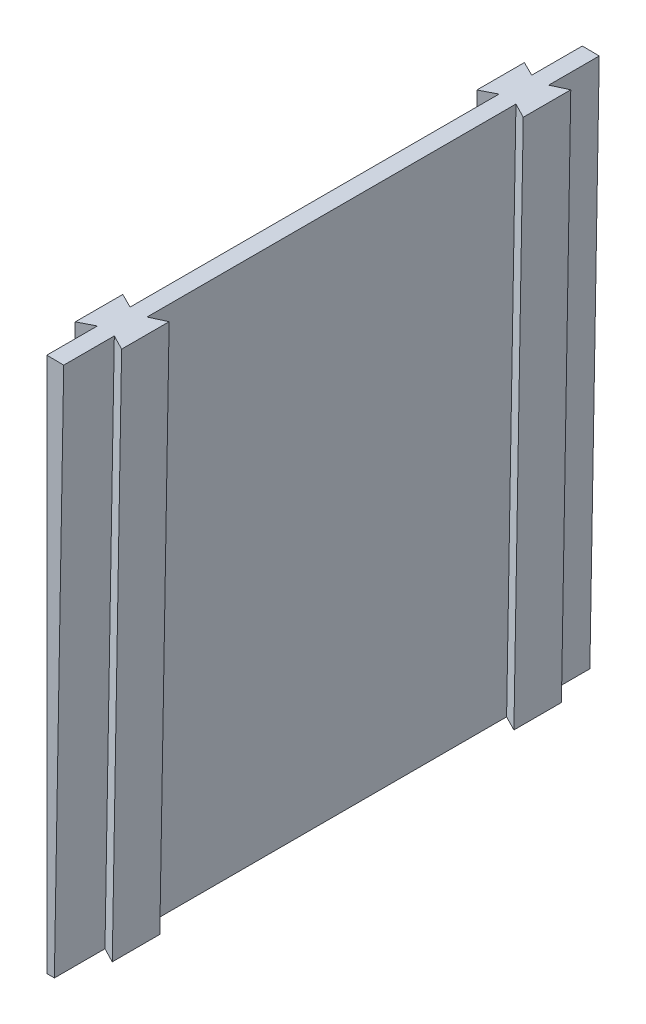
ISO-10303-21;
HEADER;
FILE_DESCRIPTION(('STEP AP214'),'2;1');
FILE_NAME('part.step','',(''),(''),'','','');
FILE_SCHEMA(('AUTOMOTIVE_DESIGN { 1 0 10303 214 1 1 1 1 }'));
ENDSEC;
DATA;
#1=APPLICATION_CONTEXT('core data for automotive mechanical design processes');
#2=APPLICATION_PROTOCOL_DEFINITION('international standard','automotive_design',2000,#1);
#3=PRODUCT_CONTEXT('',#1,'mechanical');
#4=PRODUCT('Part','Part','',(#3));
#5=PRODUCT_RELATED_PRODUCT_CATEGORY('part','',(#4));
#6=PRODUCT_DEFINITION_FORMATION('','',#4);
#7=PRODUCT_DEFINITION_CONTEXT('part definition',#1,'design');
#8=PRODUCT_DEFINITION('design','',#6,#7);
#9=PRODUCT_DEFINITION_SHAPE('','',#8);
#10=(LENGTH_UNIT() NAMED_UNIT(*) SI_UNIT(.MILLI.,.METRE.));
#11=(NAMED_UNIT(*) PLANE_ANGLE_UNIT() SI_UNIT($,.RADIAN.));
#12=(NAMED_UNIT(*) SI_UNIT($,.STERADIAN.) SOLID_ANGLE_UNIT());
#13=UNCERTAINTY_MEASURE_WITH_UNIT(LENGTH_MEASURE(1.E-05),#10,'distance_accuracy_value','');
#14=(GEOMETRIC_REPRESENTATION_CONTEXT(3) GLOBAL_UNCERTAINTY_ASSIGNED_CONTEXT((#13)) GLOBAL_UNIT_ASSIGNED_CONTEXT((#10,
#11,#12)) REPRESENTATION_CONTEXT('',''));
#15=CARTESIAN_POINT('',(0.,0.,0.));
#16=DIRECTION('',(0.,0.,1.));
#17=DIRECTION('',(1.,0.,0.));
#18=AXIS2_PLACEMENT_3D('',#15,#16,#17);
#19=CARTESIAN_POINT('',(0.,82.55,101.6));
#20=DIRECTION('',(1.,0.,0.));
#21=DIRECTION('',(0.,0.,-1.));
#22=AXIS2_PLACEMENT_3D('',#19,#20,#21);
#23=PLANE('',#22);
#24=DIRECTION('',(0.,0.,-1.));
#25=VECTOR('',#24,1.);
#26=CARTESIAN_POINT('',(0.,184.15,101.6));
#27=LINE('',#26,#25);
#28=CARTESIAN_POINT('',(0.,184.15,85.7997919351432));
#29=VERTEX_POINT('',#28);
#30=CARTESIAN_POINT('',(0.,184.15,15.8002080648568));
#31=VERTEX_POINT('',#30);
#32=EDGE_CURVE('E191',#29,#31,#27,.T.);
#33=ORIENTED_EDGE('',*,*,#32,.T.);
#34=DIRECTION('',(0.,-1.,0.));
#35=VECTOR('',#34,1.);
#36=CARTESIAN_POINT('',(0.,184.151,15.8002080648568));
#37=LINE('',#36,#35);
#38=CARTESIAN_POINT('',(0.,82.55,15.8002080648568));
#39=VERTEX_POINT('',#38);
#40=EDGE_CURVE('E68',#31,#39,#37,.T.);
#41=ORIENTED_EDGE('',*,*,#40,.T.);
#42=DIRECTION('',(0.,0.,-1.));
#43=VECTOR('',#42,1.);
#44=CARTESIAN_POINT('',(0.,82.55,101.6));
#45=LINE('',#44,#43);
#46=CARTESIAN_POINT('',(0.,82.55,85.7997919351432));
#47=VERTEX_POINT('',#46);
#48=EDGE_CURVE('E363',#47,#39,#45,.T.);
#49=ORIENTED_EDGE('',*,*,#48,.F.);
#50=DIRECTION('',(0.,-1.,0.));
#51=VECTOR('',#50,1.);
#52=CARTESIAN_POINT('',(0.,184.151,85.7997919351432));
#53=LINE('',#52,#51);
#54=EDGE_CURVE('E221',#29,#47,#53,.T.);
#55=ORIENTED_EDGE('',*,*,#54,.F.);
#56=EDGE_LOOP('',(#33,#41,#49,#55));
#57=FACE_BOUND('',#56,.T.);
#58=ADVANCED_FACE('F43',(#57),#23,.F.);
#59=CARTESIAN_POINT('',(0.,82.55,9.59979193514321));
#60=VERTEX_POINT('',#59);
#61=CARTESIAN_POINT('',(0.,82.55,0.));
#62=VERTEX_POINT('',#61);
#63=EDGE_CURVE('E60',#60,#62,#45,.T.);
#64=ORIENTED_EDGE('',*,*,#63,.F.);
#65=DIRECTION('',(0.,-1.,0.));
#66=VECTOR('',#65,1.);
#67=CARTESIAN_POINT('',(0.,184.151,9.59979193514321));
#68=LINE('',#67,#66);
#69=CARTESIAN_POINT('',(0.,184.15,9.59979193514321));
#70=VERTEX_POINT('',#69);
#71=EDGE_CURVE('E196',#70,#60,#68,.T.);
#72=ORIENTED_EDGE('',*,*,#71,.F.);
#73=CARTESIAN_POINT('',(0.,184.15,0.));
#74=VERTEX_POINT('',#73);
#75=EDGE_CURVE('E182',#70,#74,#27,.T.);
#76=ORIENTED_EDGE('',*,*,#75,.T.);
#77=DIRECTION('',(0.,-1.,0.));
#78=VECTOR('',#77,1.);
#79=CARTESIAN_POINT('',(0.,82.55,0.));
#80=LINE('',#79,#78);
#81=EDGE_CURVE('E341',#74,#62,#80,.T.);
#82=ORIENTED_EDGE('',*,*,#81,.T.);
#83=EDGE_LOOP('',(#64,#72,#76,#82));
#84=FACE_BOUND('',#83,.T.);
#85=ADVANCED_FACE('F197',(#84),#23,.F.);
#86=CARTESIAN_POINT('',(1.44069615139776,82.5374272351601,101.6));
#87=DIRECTION('',(-0.999847695156391,0.0174524064372835,0.));
#88=DIRECTION('',(-0.0174524064372835,-0.999847695156391,0.));
#89=AXIS2_PLACEMENT_3D('',#86,#87,#88);
#90=PLANE('',#89);
#91=DIRECTION('',(0.,0.,-1.));
#92=VECTOR('',#91,1.);
#93=CARTESIAN_POINT('',(1.44069615139776,82.5374272351601,101.6));
#94=LINE('',#93,#92);
#95=CARTESIAN_POINT('',(1.44069615139776,82.5374272351601,85.7997919351432));
#96=VERTEX_POINT('',#95);
#97=CARTESIAN_POINT('',(1.44069615139776,82.5374272351602,15.8002080648568));
#98=VERTEX_POINT('',#97);
#99=EDGE_CURVE('E52',#96,#98,#94,.T.);
#100=ORIENTED_EDGE('',*,*,#99,.T.);
#101=DIRECTION('',(-0.0174524064372835,-0.999847695156391,0.));
#102=VECTOR('',#101,1.);
#103=CARTESIAN_POINT('',(3.21471153043212,184.170700232415,15.8002080648568));
#104=LINE('',#103,#102);
#105=CARTESIAN_POINT('',(3.21386064542577,184.121953063049,15.8002080648568));
#106=VERTEX_POINT('',#105);
#107=EDGE_CURVE('E258',#106,#98,#104,.T.);
#108=ORIENTED_EDGE('',*,*,#107,.F.);
#109=DIRECTION('',(0.,0.,-1.));
#110=VECTOR('',#109,1.);
#111=CARTESIAN_POINT('',(3.21386064542575,184.121953063049,101.6));
#112=LINE('',#111,#110);
#113=CARTESIAN_POINT('',(3.21386064542575,184.121953063049,85.7997919351432));
#114=VERTEX_POINT('',#113);
#115=EDGE_CURVE('E369',#114,#106,#112,.T.);
#116=ORIENTED_EDGE('',*,*,#115,.F.);
#117=DIRECTION('',(-0.0174524064372835,-0.999847695156391,0.));
#118=VECTOR('',#117,1.);
#119=CARTESIAN_POINT('',(3.21471153043212,184.170700232415,85.7997919351432));
#120=LINE('',#119,#118);
#121=EDGE_CURVE('E320',#114,#96,#120,.T.);
#122=ORIENTED_EDGE('',*,*,#121,.T.);
#123=EDGE_LOOP('',(#100,#108,#116,#122));
#124=FACE_BOUND('',#123,.T.);
#125=ADVANCED_FACE('F470',(#124),#90,.F.);
#126=DIRECTION('',(-0.0174524064372835,-0.999847695156391,0.));
#127=VECTOR('',#126,1.);
#128=CARTESIAN_POINT('',(3.21471153043211,184.170700232415,92.0002080648568));
#129=LINE('',#128,#127);
#130=CARTESIAN_POINT('',(3.21386064542575,184.121953063049,92.0002080648568));
#131=VERTEX_POINT('',#130);
#132=CARTESIAN_POINT('',(1.44069615139776,82.5374272351602,92.0002080648568));
#133=VERTEX_POINT('',#132);
#134=EDGE_CURVE('E301',#131,#133,#129,.T.);
#135=ORIENTED_EDGE('',*,*,#134,.F.);
#136=CARTESIAN_POINT('',(3.21386064542575,184.121953063049,101.6));
#137=VERTEX_POINT('',#136);
#138=EDGE_CURVE('E366',#137,#131,#112,.T.);
#139=ORIENTED_EDGE('',*,*,#138,.F.);
#140=DIRECTION('',(0.0174524064372835,0.999847695156391,0.));
#141=VECTOR('',#140,1.);
#142=CARTESIAN_POINT('',(1.44069615139776,82.5374272351601,101.6));
#143=LINE('',#142,#141);
#144=CARTESIAN_POINT('',(1.44069615139776,82.5374272351601,101.6));
#145=VERTEX_POINT('',#144);
#146=EDGE_CURVE('E340',#145,#137,#143,.T.);
#147=ORIENTED_EDGE('',*,*,#146,.F.);
#148=EDGE_CURVE('E11',#145,#133,#94,.T.);
#149=ORIENTED_EDGE('',*,*,#148,.T.);
#150=EDGE_LOOP('',(#135,#139,#147,#149));
#151=FACE_BOUND('',#150,.T.);
#152=ADVANCED_FACE('F449',(#151),#90,.F.);
#153=CARTESIAN_POINT('',(0.,0.,101.6));
#154=DIRECTION('',(0.,0.,-1.));
#155=DIRECTION('',(-1.,0.,0.));
#156=AXIS2_PLACEMENT_3D('',#153,#154,#155);
#157=CYLINDRICAL_SURFACE('',#156,82.55);
#158=CARTESIAN_POINT('',(0.,0.,0.));
#159=DIRECTION('',(0.,0.,-1.));
#160=DIRECTION('',(-1.,0.,0.));
#161=AXIS2_PLACEMENT_3D('',#158,#159,#160);
#162=CIRCLE('',#161,82.55);
#163=CARTESIAN_POINT('',(1.44069615139776,82.5374272351601,0.));
#164=VERTEX_POINT('',#163);
#165=EDGE_CURVE('E335',#62,#164,#162,.T.);
#166=ORIENTED_EDGE('',*,*,#165,.T.);
#167=CARTESIAN_POINT('',(1.44069615139776,82.5374272351602,9.59979193514321));
#168=VERTEX_POINT('',#167);
#169=EDGE_CURVE('E53',#168,#164,#94,.T.);
#170=ORIENTED_EDGE('',*,*,#169,.F.);
#171=DIRECTION('',(0.,0.,-1.));
#172=VECTOR('',#171,1.);
#173=CARTESIAN_POINT('',(1.44069615139776,82.5374272351602,15.8002080648568));
#174=LINE('',#173,#172);
#175=EDGE_CURVE('E280',#98,#168,#174,.T.);
#176=ORIENTED_EDGE('',*,*,#175,.F.);
#177=ORIENTED_EDGE('',*,*,#99,.F.);
#178=DIRECTION('',(0.,0.,-1.));
#179=VECTOR('',#178,1.);
#180=CARTESIAN_POINT('',(1.44069615139776,82.5374272351602,85.7997919351432));
#181=LINE('',#180,#179);
#182=EDGE_CURVE('E288',#133,#96,#181,.T.);
#183=ORIENTED_EDGE('',*,*,#182,.F.);
#184=ORIENTED_EDGE('',*,*,#148,.F.);
#185=CARTESIAN_POINT('',(0.,0.,101.6));
#186=DIRECTION('',(0.,0.,-1.));
#187=DIRECTION('',(-1.,0.,0.));
#188=AXIS2_PLACEMENT_3D('',#185,#186,#187);
#189=CIRCLE('',#188,82.55);
#190=CARTESIAN_POINT('',(0.,82.55,101.6));
#191=VERTEX_POINT('',#190);
#192=EDGE_CURVE('E336',#191,#145,#189,.T.);
#193=ORIENTED_EDGE('',*,*,#192,.F.);
#194=CARTESIAN_POINT('',(0.,82.55,92.0002080648568));
#195=VERTEX_POINT('',#194);
#196=EDGE_CURVE('E192',#191,#195,#45,.T.);
#197=ORIENTED_EDGE('',*,*,#196,.T.);
#198=DIRECTION('',(0.,0.,1.));
#199=VECTOR('',#198,1.);
#200=CARTESIAN_POINT('',(0.,82.55,85.7997919351432));
#201=LINE('',#200,#199);
#202=EDGE_CURVE('E225',#47,#195,#201,.T.);
#203=ORIENTED_EDGE('',*,*,#202,.F.);
#204=ORIENTED_EDGE('',*,*,#48,.T.);
#205=DIRECTION('',(0.,0.,1.));
#206=VECTOR('',#205,1.);
#207=CARTESIAN_POINT('',(0.,82.55,15.8002080648568));
#208=LINE('',#207,#206);
#209=EDGE_CURVE('E389',#60,#39,#208,.T.);
#210=ORIENTED_EDGE('',*,*,#209,.F.);
#211=ORIENTED_EDGE('',*,*,#63,.T.);
#212=EDGE_LOOP('',(#166,#170,#176,#177,#183,#184,#193,#197,#203,#204,#210,#211));
#213=FACE_BOUND('',#212,.T.);
#214=ADVANCED_FACE('F45',(#213),#157,.F.);
#215=CARTESIAN_POINT('',(3.21386064542575,184.121953063049,9.59979193514321));
#216=VERTEX_POINT('',#215);
#217=CARTESIAN_POINT('',(3.21386064542575,184.121953063049,0.));
#218=VERTEX_POINT('',#217);
#219=EDGE_CURVE('E365',#216,#218,#112,.T.);
#220=ORIENTED_EDGE('',*,*,#219,.F.);
#221=DIRECTION('',(-0.0174524064372835,-0.999847695156391,0.));
#222=VECTOR('',#221,1.);
#223=CARTESIAN_POINT('',(3.21471153043211,184.170700232415,9.59979193514321));
#224=LINE('',#223,#222);
#225=EDGE_CURVE('E262',#216,#168,#224,.T.);
#226=ORIENTED_EDGE('',*,*,#225,.T.);
#227=ORIENTED_EDGE('',*,*,#169,.T.);
#228=DIRECTION('',(0.0174524064372835,0.999847695156391,0.));
#229=VECTOR('',#228,1.);
#230=CARTESIAN_POINT('',(1.44069615139776,82.5374272351601,0.));
#231=LINE('',#230,#229);
#232=EDGE_CURVE('E353',#164,#218,#231,.T.);
#233=ORIENTED_EDGE('',*,*,#232,.T.);
#234=EDGE_LOOP('',(#220,#226,#227,#233));
#235=FACE_BOUND('',#234,.T.);
#236=ADVANCED_FACE('F381',(#235),#90,.F.);
#237=CARTESIAN_POINT('',(0.,0.,101.6));
#238=DIRECTION('',(0.,0.,-1.));
#239=DIRECTION('',(-1.,0.,0.));
#240=AXIS2_PLACEMENT_3D('',#237,#238,#239);
#241=CYLINDRICAL_SURFACE('',#240,184.15);
#242=CARTESIAN_POINT('',(0.,0.,0.));
#243=DIRECTION('',(0.,0.,1.));
#244=DIRECTION('',(-1.,0.,0.));
#245=AXIS2_PLACEMENT_3D('',#242,#243,#244);
#246=CIRCLE('',#245,184.15);
#247=EDGE_CURVE('E188',#218,#74,#246,.T.);
#248=ORIENTED_EDGE('',*,*,#247,.T.);
#249=ORIENTED_EDGE('',*,*,#75,.F.);
#250=CARTESIAN_POINT('',(0.,0.,9.59979193514321));
#251=DIRECTION('',(0.450153111117083,0.,-0.892951385323754));
#252=DIRECTION('',(-0.892951385323754,0.,-0.450153111117083));
#253=AXIS2_PLACEMENT_3D('',#250,#251,#252);
#254=ELLIPSE('',#253,206.22623249891,184.15);
#255=CARTESIAN_POINT('',(-2.79357446026696,184.128809374674,8.1915));
#256=VERTEX_POINT('',#255);
#257=EDGE_CURVE('E185',#70,#256,#254,.F.);
#258=ORIENTED_EDGE('',*,*,#257,.T.);
#259=DIRECTION('',(0.,0.,-1.));
#260=VECTOR('',#259,1.);
#261=CARTESIAN_POINT('',(-2.79357446026696,184.128809374674,101.6));
#262=LINE('',#261,#260);
#263=CARTESIAN_POINT('',(-2.79357446026696,184.128809374674,17.2085));
#264=VERTEX_POINT('',#263);
#265=EDGE_CURVE('E213',#256,#264,#262,.F.);
#266=ORIENTED_EDGE('',*,*,#265,.T.);
#267=CARTESIAN_POINT('',(0.,0.,15.8002080648568));
#268=DIRECTION('',(0.450153111117083,0.,0.892951385323754));
#269=DIRECTION('',(0.892951385323754,0.,-0.450153111117083));
#270=AXIS2_PLACEMENT_3D('',#267,#268,#269);
#271=ELLIPSE('',#270,206.22623249891,184.15);
#272=EDGE_CURVE('E207',#264,#31,#271,.F.);
#273=ORIENTED_EDGE('',*,*,#272,.T.);
#274=ORIENTED_EDGE('',*,*,#32,.F.);
#275=CARTESIAN_POINT('',(0.,0.,85.7997919351432));
#276=DIRECTION('',(0.450153111117083,0.,-0.892951385323754));
#277=DIRECTION('',(-0.892951385323754,0.,-0.450153111117083));
#278=AXIS2_PLACEMENT_3D('',#275,#276,#277);
#279=ELLIPSE('',#278,206.22623249891,184.15);
#280=CARTESIAN_POINT('',(-2.79357446026696,184.128809374674,84.3915));
#281=VERTEX_POINT('',#280);
#282=EDGE_CURVE('E220',#29,#281,#279,.F.);
#283=ORIENTED_EDGE('',*,*,#282,.T.);
#284=DIRECTION('',(0.,0.,-1.));
#285=VECTOR('',#284,1.);
#286=CARTESIAN_POINT('',(-2.79357446026696,184.128809374674,101.6));
#287=LINE('',#286,#285);
#288=CARTESIAN_POINT('',(-2.79357446026696,184.128809374674,93.4085));
#289=VERTEX_POINT('',#288);
#290=EDGE_CURVE('E217',#281,#289,#287,.F.);
#291=ORIENTED_EDGE('',*,*,#290,.T.);
#292=CARTESIAN_POINT('',(0.,0.,92.0002080648568));
#293=DIRECTION('',(0.450153111117083,0.,0.892951385323754));
#294=DIRECTION('',(0.892951385323754,0.,-0.450153111117083));
#295=AXIS2_PLACEMENT_3D('',#292,#293,#294);
#296=ELLIPSE('',#295,206.22623249891,184.15);
#297=CARTESIAN_POINT('',(0.,184.15,92.0002080648568));
#298=VERTEX_POINT('',#297);
#299=EDGE_CURVE('E224',#289,#298,#296,.F.);
#300=ORIENTED_EDGE('',*,*,#299,.T.);
#301=CARTESIAN_POINT('',(0.,184.15,101.6));
#302=VERTEX_POINT('',#301);
#303=EDGE_CURVE('E194',#302,#298,#27,.T.);
#304=ORIENTED_EDGE('',*,*,#303,.F.);
#305=CARTESIAN_POINT('',(0.,0.,101.6));
#306=DIRECTION('',(0.,0.,1.));
#307=DIRECTION('',(-1.,0.,0.));
#308=AXIS2_PLACEMENT_3D('',#305,#306,#307);
#309=CIRCLE('',#308,184.15);
#310=EDGE_CURVE('E344',#137,#302,#309,.T.);
#311=ORIENTED_EDGE('',*,*,#310,.F.);
#312=ORIENTED_EDGE('',*,*,#138,.T.);
#313=CARTESIAN_POINT('',(0.,0.,92.0002080648568));
#314=DIRECTION('',(-0.450029888864768,0.00785530092977308,0.892978943411135));
#315=DIRECTION('',(-0.892842938392813,0.0155846314603472,-0.450098441037438));
#316=AXIS2_PLACEMENT_3D('',#313,#314,#315);
#317=ELLIPSE('',#316,206.219868182508,184.15);
#318=CARTESIAN_POINT('',(6.00706516560163,184.051997185839,93.4085));
#319=VERTEX_POINT('',#318);
#320=EDGE_CURVE('E300',#131,#319,#317,.F.);
#321=ORIENTED_EDGE('',*,*,#320,.T.);
#322=DIRECTION('',(0.,0.,-1.));
#323=VECTOR('',#322,1.);
#324=CARTESIAN_POINT('',(6.00706516560163,184.051997185839,101.6));
#325=LINE('',#324,#323);
#326=CARTESIAN_POINT('',(6.00706516560163,184.051997185839,84.3915));
#327=VERTEX_POINT('',#326);
#328=EDGE_CURVE('E297',#319,#327,#325,.T.);
#329=ORIENTED_EDGE('',*,*,#328,.T.);
#330=CARTESIAN_POINT('',(0.,0.,85.7997919351432));
#331=DIRECTION('',(-0.450029888864768,0.00785530092977308,-0.892978943411135));
#332=DIRECTION('',(0.892842938392813,-0.0155846314603472,-0.450098441037438));
#333=AXIS2_PLACEMENT_3D('',#330,#331,#332);
#334=ELLIPSE('',#333,206.219868182508,184.15);
#335=EDGE_CURVE('E304',#327,#114,#334,.F.);
#336=ORIENTED_EDGE('',*,*,#335,.T.);
#337=ORIENTED_EDGE('',*,*,#115,.T.);
#338=CARTESIAN_POINT('',(0.,0.,15.8002080648568));
#339=DIRECTION('',(-0.450029888864768,0.00785530092977308,0.892978943411135));
#340=DIRECTION('',(-0.892842938392813,0.0155846314603472,-0.450098441037438));
#341=AXIS2_PLACEMENT_3D('',#338,#339,#340);
#342=ELLIPSE('',#341,206.219868182508,184.15);
#343=CARTESIAN_POINT('',(6.00706516560163,184.051997185839,17.2085));
#344=VERTEX_POINT('',#343);
#345=EDGE_CURVE('E257',#106,#344,#342,.F.);
#346=ORIENTED_EDGE('',*,*,#345,.T.);
#347=DIRECTION('',(0.,0.,-1.));
#348=VECTOR('',#347,1.);
#349=CARTESIAN_POINT('',(6.00706516560163,184.051997185839,101.6));
#350=LINE('',#349,#348);
#351=CARTESIAN_POINT('',(6.00706516560163,184.051997185839,8.1915));
#352=VERTEX_POINT('',#351);
#353=EDGE_CURVE('E291',#344,#352,#350,.T.);
#354=ORIENTED_EDGE('',*,*,#353,.T.);
#355=CARTESIAN_POINT('',(0.,0.,9.59979193514321));
#356=DIRECTION('',(-0.450029888864768,0.00785530092977308,-0.892978943411135));
#357=DIRECTION('',(0.892842938392813,-0.0155846314603472,-0.450098441037438));
#358=AXIS2_PLACEMENT_3D('',#355,#356,#357);
#359=ELLIPSE('',#358,206.219868182508,184.15);
#360=EDGE_CURVE('E272',#352,#216,#359,.F.);
#361=ORIENTED_EDGE('',*,*,#360,.T.);
#362=ORIENTED_EDGE('',*,*,#219,.T.);
#363=EDGE_LOOP('',(#248,#249,#258,#266,#273,#274,#283,#291,#300,#304,#311,#312,#321,#329,#336,
#337,#346,#354,#361,#362));
#364=FACE_BOUND('',#363,.T.);
#365=ADVANCED_FACE('F183',(#364),#241,.T.);
#366=ORIENTED_EDGE('',*,*,#303,.T.);
#367=DIRECTION('',(0.,-1.,0.));
#368=VECTOR('',#367,1.);
#369=CARTESIAN_POINT('',(0.,184.151,92.0002080648568));
#370=LINE('',#369,#368);
#371=EDGE_CURVE('E242',#298,#195,#370,.T.);
#372=ORIENTED_EDGE('',*,*,#371,.T.);
#373=ORIENTED_EDGE('',*,*,#196,.F.);
#374=DIRECTION('',(0.,-1.,0.));
#375=VECTOR('',#374,1.);
#376=CARTESIAN_POINT('',(0.,82.55,101.6));
#377=LINE('',#376,#375);
#378=EDGE_CURVE('E347',#302,#191,#377,.T.);
#379=ORIENTED_EDGE('',*,*,#378,.F.);
#380=EDGE_LOOP('',(#366,#372,#373,#379));
#381=FACE_BOUND('',#380,.T.);
#382=ADVANCED_FACE('F443',(#381),#23,.F.);
#383=CARTESIAN_POINT('',(0.,0.,101.6));
#384=DIRECTION('',(0.,0.,-1.));
#385=DIRECTION('',(-1.,0.,0.));
#386=AXIS2_PLACEMENT_3D('',#383,#384,#385);
#387=PLANE('',#386);
#388=ORIENTED_EDGE('',*,*,#192,.T.);
#389=ORIENTED_EDGE('',*,*,#146,.T.);
#390=ORIENTED_EDGE('',*,*,#310,.T.);
#391=ORIENTED_EDGE('',*,*,#378,.T.);
#392=EDGE_LOOP('',(#388,#389,#390,#391));
#393=FACE_BOUND('',#392,.T.);
#394=ADVANCED_FACE('F446',(#393),#387,.F.);
#395=CARTESIAN_POINT('',(0.,0.,0.));
#396=DIRECTION('',(0.,0.,-1.));
#397=DIRECTION('',(-1.,0.,0.));
#398=AXIS2_PLACEMENT_3D('',#395,#396,#397);
#399=PLANE('',#398);
#400=ORIENTED_EDGE('',*,*,#165,.F.);
#401=ORIENTED_EDGE('',*,*,#81,.F.);
#402=ORIENTED_EDGE('',*,*,#247,.F.);
#403=ORIENTED_EDGE('',*,*,#232,.F.);
#404=EDGE_LOOP('',(#400,#401,#402,#403));
#405=FACE_BOUND('',#404,.T.);
#406=ADVANCED_FACE('F385',(#405),#399,.T.);
#407=CARTESIAN_POINT('',(3.21471153043211,184.170700232415,92.0002080648568));
#408=DIRECTION('',(-0.450029888864768,0.00785530092977308,0.892978943411135));
#409=DIRECTION('',(0.893006495655164,0.,0.45004377422389));
#410=AXIS2_PLACEMENT_3D('',#407,#408,#409);
#411=PLANE('',#410);
#412=ORIENTED_EDGE('',*,*,#320,.F.);
#413=ORIENTED_EDGE('',*,*,#134,.T.);
#414=DIRECTION('',(-0.892842938392813,0.0155846314603458,-0.450098441037438));
#415=VECTOR('',#414,1.);
#416=CARTESIAN_POINT('',(1.44069615139776,82.5374272351602,92.0002080648568));
#417=LINE('',#416,#415);
#418=CARTESIAN_POINT('',(4.23427061166471,82.4886652115744,93.4085));
#419=VERTEX_POINT('',#418);
#420=EDGE_CURVE('E316',#419,#133,#417,.T.);
#421=ORIENTED_EDGE('',*,*,#420,.F.);
#422=DIRECTION('',(-0.0174524064372835,-0.999847695156391,0.));
#423=VECTOR('',#422,1.);
#424=CARTESIAN_POINT('',(6.00828599069907,184.12193820883,93.4085));
#425=LINE('',#424,#423);
#426=EDGE_CURVE('E324',#319,#419,#425,.T.);
#427=ORIENTED_EDGE('',*,*,#426,.F.);
#428=EDGE_LOOP('',(#412,#413,#421,#427));
#429=FACE_BOUND('',#428,.T.);
#430=ADVANCED_FACE('F453',(#429),#411,.T.);
#431=CARTESIAN_POINT('',(6.00828599069907,184.12193820883,84.3915));
#432=DIRECTION('',(-0.450029888864768,0.00785530092977308,-0.892978943411135));
#433=DIRECTION('',(-0.893006495655164,0.,0.45004377422389));
#434=AXIS2_PLACEMENT_3D('',#431,#432,#433);
#435=PLANE('',#434);
#436=ORIENTED_EDGE('',*,*,#335,.F.);
#437=DIRECTION('',(-0.0174524064372835,-0.999847695156391,0.));
#438=VECTOR('',#437,1.);
#439=CARTESIAN_POINT('',(6.00828599069907,184.12193820883,84.3915));
#440=LINE('',#439,#438);
#441=CARTESIAN_POINT('',(4.23427061166471,82.4886652115744,84.3915));
#442=VERTEX_POINT('',#441);
#443=EDGE_CURVE('E327',#327,#442,#440,.T.);
#444=ORIENTED_EDGE('',*,*,#443,.T.);
#445=DIRECTION('',(0.892842938392813,-0.0155846314603458,-0.450098441037438));
#446=VECTOR('',#445,1.);
#447=CARTESIAN_POINT('',(4.23427061166471,82.4886652115744,84.3915));
#448=LINE('',#447,#446);
#449=EDGE_CURVE('E308',#96,#442,#448,.T.);
#450=ORIENTED_EDGE('',*,*,#449,.F.);
#451=ORIENTED_EDGE('',*,*,#121,.F.);
#452=EDGE_LOOP('',(#436,#444,#450,#451));
#453=FACE_BOUND('',#452,.T.);
#454=ADVANCED_FACE('F466',(#453),#435,.T.);
#455=CARTESIAN_POINT('',(6.00828599069907,184.12193820883,93.4085));
#456=DIRECTION('',(0.999847695156391,-0.0174524064372835,0.));
#457=DIRECTION('',(0.0174524064372835,0.999847695156391,0.));
#458=AXIS2_PLACEMENT_3D('',#455,#456,#457);
#459=PLANE('',#458);
#460=ORIENTED_EDGE('',*,*,#328,.F.);
#461=ORIENTED_EDGE('',*,*,#426,.T.);
#462=DIRECTION('',(0.,0.,1.));
#463=VECTOR('',#462,1.);
#464=CARTESIAN_POINT('',(4.23427061166471,82.4886652115744,93.4085));
#465=LINE('',#464,#463);
#466=EDGE_CURVE('E312',#442,#419,#465,.T.);
#467=ORIENTED_EDGE('',*,*,#466,.F.);
#468=ORIENTED_EDGE('',*,*,#443,.F.);
#469=EDGE_LOOP('',(#460,#461,#467,#468));
#470=FACE_BOUND('',#469,.T.);
#471=ADVANCED_FACE('F462',(#470),#459,.T.);
#472=CARTESIAN_POINT('',(1.44069615139764,82.5374272351602,0.));
#473=DIRECTION('',(0.0174524064372821,0.999847695156391,0.));
#474=DIRECTION('',(-0.999847695156391,0.0174524064372821,0.));
#475=AXIS2_PLACEMENT_3D('',#472,#473,#474);
#476=PLANE('',#475);
#477=ORIENTED_EDGE('',*,*,#182,.T.);
#478=ORIENTED_EDGE('',*,*,#449,.T.);
#479=ORIENTED_EDGE('',*,*,#466,.T.);
#480=ORIENTED_EDGE('',*,*,#420,.T.);
#481=EDGE_LOOP('',(#477,#478,#479,#480));
#482=FACE_BOUND('',#481,.T.);
#483=ADVANCED_FACE('F456',(#482),#476,.F.);
#484=CARTESIAN_POINT('',(6.00828599069907,184.12193820883,17.2085));
#485=DIRECTION('',(-0.450029888864768,0.00785530092977308,0.892978943411135));
#486=DIRECTION('',(0.893006495655164,0.,0.45004377422389));
#487=AXIS2_PLACEMENT_3D('',#484,#485,#486);
#488=PLANE('',#487);
#489=ORIENTED_EDGE('',*,*,#345,.F.);
#490=ORIENTED_EDGE('',*,*,#107,.T.);
#491=DIRECTION('',(-0.892842938392813,0.0155846314603458,-0.450098441037438));
#492=VECTOR('',#491,1.);
#493=CARTESIAN_POINT('',(4.23427061166471,82.4886652115744,17.2085));
#494=LINE('',#493,#492);
#495=CARTESIAN_POINT('',(4.23427061166471,82.4886652115744,17.2085));
#496=VERTEX_POINT('',#495);
#497=EDGE_CURVE('E284',#496,#98,#494,.T.);
#498=ORIENTED_EDGE('',*,*,#497,.F.);
#499=DIRECTION('',(-0.0174524064372835,-0.999847695156391,0.));
#500=VECTOR('',#499,1.);
#501=CARTESIAN_POINT('',(6.00828599069907,184.12193820883,17.2085));
#502=LINE('',#501,#500);
#503=EDGE_CURVE('E269',#344,#496,#502,.T.);
#504=ORIENTED_EDGE('',*,*,#503,.F.);
#505=EDGE_LOOP('',(#489,#490,#498,#504));
#506=FACE_BOUND('',#505,.T.);
#507=ADVANCED_FACE('F485',(#506),#488,.T.);
#508=CARTESIAN_POINT('',(3.21471153043211,184.170700232415,9.59979193514321));
#509=DIRECTION('',(-0.450029888864768,0.00785530092977308,-0.892978943411135));
#510=DIRECTION('',(-0.893006495655164,0.,0.45004377422389));
#511=AXIS2_PLACEMENT_3D('',#508,#509,#510);
#512=PLANE('',#511);
#513=ORIENTED_EDGE('',*,*,#360,.F.);
#514=DIRECTION('',(-0.0174524064372835,-0.999847695156391,0.));
#515=VECTOR('',#514,1.);
#516=CARTESIAN_POINT('',(6.00828599069907,184.12193820883,8.1915));
#517=LINE('',#516,#515);
#518=CARTESIAN_POINT('',(4.23427061166471,82.4886652115744,8.1915));
#519=VERTEX_POINT('',#518);
#520=EDGE_CURVE('E266',#352,#519,#517,.T.);
#521=ORIENTED_EDGE('',*,*,#520,.T.);
#522=DIRECTION('',(0.892842938392813,-0.0155846314603458,-0.450098441037438));
#523=VECTOR('',#522,1.);
#524=CARTESIAN_POINT('',(1.44069615139776,82.5374272351602,9.59979193514321));
#525=LINE('',#524,#523);
#526=EDGE_CURVE('E276',#168,#519,#525,.T.);
#527=ORIENTED_EDGE('',*,*,#526,.F.);
#528=ORIENTED_EDGE('',*,*,#225,.F.);
#529=EDGE_LOOP('',(#513,#521,#527,#528));
#530=FACE_BOUND('',#529,.T.);
#531=ADVANCED_FACE('F478',(#530),#512,.T.);
#532=CARTESIAN_POINT('',(6.00828599069907,184.12193820883,8.1915));
#533=DIRECTION('',(0.999847695156391,-0.0174524064372835,0.));
#534=DIRECTION('',(0.0174524064372835,0.999847695156391,0.));
#535=AXIS2_PLACEMENT_3D('',#532,#533,#534);
#536=PLANE('',#535);
#537=ORIENTED_EDGE('',*,*,#353,.F.);
#538=ORIENTED_EDGE('',*,*,#503,.T.);
#539=DIRECTION('',(0.,0.,1.));
#540=VECTOR('',#539,1.);
#541=CARTESIAN_POINT('',(4.23427061166471,82.4886652115744,8.1915));
#542=LINE('',#541,#540);
#543=EDGE_CURVE('E261',#519,#496,#542,.T.);
#544=ORIENTED_EDGE('',*,*,#543,.F.);
#545=ORIENTED_EDGE('',*,*,#520,.F.);
#546=EDGE_LOOP('',(#537,#538,#544,#545));
#547=FACE_BOUND('',#546,.T.);
#548=ADVANCED_FACE('F482',(#547),#536,.T.);
#549=CARTESIAN_POINT('',(1.44069615139764,82.5374272351602,0.));
#550=DIRECTION('',(-0.0174524064372821,-0.999847695156391,0.));
#551=DIRECTION('',(0.999847695156391,-0.0174524064372821,0.));
#552=AXIS2_PLACEMENT_3D('',#549,#550,#551);
#553=PLANE('',#552);
#554=ORIENTED_EDGE('',*,*,#497,.T.);
#555=ORIENTED_EDGE('',*,*,#175,.T.);
#556=ORIENTED_EDGE('',*,*,#526,.T.);
#557=ORIENTED_EDGE('',*,*,#543,.T.);
#558=EDGE_LOOP('',(#554,#555,#556,#557));
#559=FACE_BOUND('',#558,.T.);
#560=ADVANCED_FACE('F474',(#559),#553,.T.);
#561=CARTESIAN_POINT('',(-2.79357446026696,184.151,84.3915));
#562=DIRECTION('',(0.450153111117083,0.,-0.892951385323754));
#563=DIRECTION('',(-0.892951385323754,0.,-0.450153111117083));
#564=AXIS2_PLACEMENT_3D('',#561,#562,#563);
#565=PLANE('',#564);
#566=ORIENTED_EDGE('',*,*,#282,.F.);
#567=ORIENTED_EDGE('',*,*,#54,.T.);
#568=DIRECTION('',(0.892951385323754,0.,0.450153111117083));
#569=VECTOR('',#568,1.);
#570=CARTESIAN_POINT('',(-2.79357446026696,82.55,84.3915));
#571=LINE('',#570,#569);
#572=CARTESIAN_POINT('',(-2.79357446026696,82.55,84.3915));
#573=VERTEX_POINT('',#572);
#574=EDGE_CURVE('E238',#573,#47,#571,.T.);
#575=ORIENTED_EDGE('',*,*,#574,.F.);
#576=DIRECTION('',(0.,-1.,0.));
#577=VECTOR('',#576,1.);
#578=CARTESIAN_POINT('',(-2.79357446026696,184.151,84.3915));
#579=LINE('',#578,#577);
#580=EDGE_CURVE('E246',#281,#573,#579,.T.);
#581=ORIENTED_EDGE('',*,*,#580,.F.);
#582=EDGE_LOOP('',(#566,#567,#575,#581));
#583=FACE_BOUND('',#582,.T.);
#584=ADVANCED_FACE('F426',(#583),#565,.T.);
#585=CARTESIAN_POINT('',(0.,184.151,92.0002080648568));
#586=DIRECTION('',(0.450153111117083,0.,0.892951385323754));
#587=DIRECTION('',(0.892951385323754,0.,-0.450153111117083));
#588=AXIS2_PLACEMENT_3D('',#585,#586,#587);
#589=PLANE('',#588);
#590=ORIENTED_EDGE('',*,*,#299,.F.);
#591=DIRECTION('',(0.,-1.,0.));
#592=VECTOR('',#591,1.);
#593=CARTESIAN_POINT('',(-2.79357446026696,184.151,93.4085));
#594=LINE('',#593,#592);
#595=CARTESIAN_POINT('',(-2.79357446026696,82.55,93.4085));
#596=VERTEX_POINT('',#595);
#597=EDGE_CURVE('E249',#289,#596,#594,.T.);
#598=ORIENTED_EDGE('',*,*,#597,.T.);
#599=DIRECTION('',(-0.892951385323754,0.,0.450153111117083));
#600=VECTOR('',#599,1.);
#601=CARTESIAN_POINT('',(0.,82.55,92.0002080648568));
#602=LINE('',#601,#600);
#603=EDGE_CURVE('E229',#195,#596,#602,.T.);
#604=ORIENTED_EDGE('',*,*,#603,.F.);
#605=ORIENTED_EDGE('',*,*,#371,.F.);
#606=EDGE_LOOP('',(#590,#598,#604,#605));
#607=FACE_BOUND('',#606,.T.);
#608=ADVANCED_FACE('F438',(#607),#589,.T.);
#609=CARTESIAN_POINT('',(-2.79357446026696,184.151,93.4085));
#610=DIRECTION('',(-1.,0.,0.));
#611=DIRECTION('',(0.,0.,1.));
#612=AXIS2_PLACEMENT_3D('',#609,#610,#611);
#613=PLANE('',#612);
#614=ORIENTED_EDGE('',*,*,#290,.F.);
#615=ORIENTED_EDGE('',*,*,#580,.T.);
#616=DIRECTION('',(0.,0.,-1.));
#617=VECTOR('',#616,1.);
#618=CARTESIAN_POINT('',(-2.79357446026696,82.55,93.4085));
#619=LINE('',#618,#617);
#620=EDGE_CURVE('E234',#596,#573,#619,.T.);
#621=ORIENTED_EDGE('',*,*,#620,.F.);
#622=ORIENTED_EDGE('',*,*,#597,.F.);
#623=EDGE_LOOP('',(#614,#615,#621,#622));
#624=FACE_BOUND('',#623,.T.);
#625=ADVANCED_FACE('F430',(#624),#613,.T.);
#626=CARTESIAN_POINT('',(0.,82.55,0.));
#627=DIRECTION('',(0.,-1.,0.));
#628=DIRECTION('',(0.,0.,-1.));
#629=AXIS2_PLACEMENT_3D('',#626,#627,#628);
#630=PLANE('',#629);
#631=ORIENTED_EDGE('',*,*,#202,.T.);
#632=ORIENTED_EDGE('',*,*,#603,.T.);
#633=ORIENTED_EDGE('',*,*,#620,.T.);
#634=ORIENTED_EDGE('',*,*,#574,.T.);
#635=EDGE_LOOP('',(#631,#632,#633,#634));
#636=FACE_BOUND('',#635,.T.);
#637=ADVANCED_FACE('F433',(#636),#630,.T.);
#638=CARTESIAN_POINT('',(-2.79357446026696,184.151,17.2085));
#639=DIRECTION('',(0.450153111117083,0.,0.892951385323754));
#640=DIRECTION('',(0.892951385323754,0.,-0.450153111117083));
#641=AXIS2_PLACEMENT_3D('',#638,#639,#640);
#642=PLANE('',#641);
#643=ORIENTED_EDGE('',*,*,#272,.F.);
#644=DIRECTION('',(0.,-1.,0.));
#645=VECTOR('',#644,1.);
#646=CARTESIAN_POINT('',(-2.79357446026696,184.151,17.2085));
#647=LINE('',#646,#645);
#648=CARTESIAN_POINT('',(-2.79357446026696,82.55,17.2085));
#649=VERTEX_POINT('',#648);
#650=EDGE_CURVE('E398',#264,#649,#647,.T.);
#651=ORIENTED_EDGE('',*,*,#650,.T.);
#652=DIRECTION('',(-0.892951385323754,0.,0.450153111117083));
#653=VECTOR('',#652,1.);
#654=CARTESIAN_POINT('',(-2.79357446026696,82.55,17.2085));
#655=LINE('',#654,#653);
#656=EDGE_CURVE('E230',#39,#649,#655,.T.);
#657=ORIENTED_EDGE('',*,*,#656,.F.);
#658=ORIENTED_EDGE('',*,*,#40,.F.);
#659=EDGE_LOOP('',(#643,#651,#657,#658));
#660=FACE_BOUND('',#659,.T.);
#661=ADVANCED_FACE('F396',(#660),#642,.T.);
#662=CARTESIAN_POINT('',(0.,184.151,9.59979193514321));
#663=DIRECTION('',(0.450153111117083,0.,-0.892951385323754));
#664=DIRECTION('',(-0.892951385323754,0.,-0.450153111117083));
#665=AXIS2_PLACEMENT_3D('',#662,#663,#664);
#666=PLANE('',#665);
#667=ORIENTED_EDGE('',*,*,#257,.F.);
#668=ORIENTED_EDGE('',*,*,#71,.T.);
#669=DIRECTION('',(0.892951385323754,0.,0.450153111117083));
#670=VECTOR('',#669,1.);
#671=CARTESIAN_POINT('',(0.,82.55,9.59979193514321));
#672=LINE('',#671,#670);
#673=CARTESIAN_POINT('',(-2.79357446026696,82.55,8.1915));
#674=VERTEX_POINT('',#673);
#675=EDGE_CURVE('E405',#674,#60,#672,.T.);
#676=ORIENTED_EDGE('',*,*,#675,.F.);
#677=DIRECTION('',(0.,-1.,0.));
#678=VECTOR('',#677,1.);
#679=CARTESIAN_POINT('',(-2.79357446026696,184.151,8.1915));
#680=LINE('',#679,#678);
#681=EDGE_CURVE('E202',#256,#674,#680,.T.);
#682=ORIENTED_EDGE('',*,*,#681,.F.);
#683=EDGE_LOOP('',(#667,#668,#676,#682));
#684=FACE_BOUND('',#683,.T.);
#685=ADVANCED_FACE('F204',(#684),#666,.T.);
#686=CARTESIAN_POINT('',(-2.79357446026696,184.151,8.1915));
#687=DIRECTION('',(-1.,0.,0.));
#688=DIRECTION('',(0.,0.,1.));
#689=AXIS2_PLACEMENT_3D('',#686,#687,#688);
#690=PLANE('',#689);
#691=ORIENTED_EDGE('',*,*,#265,.F.);
#692=ORIENTED_EDGE('',*,*,#681,.T.);
#693=DIRECTION('',(0.,0.,-1.));
#694=VECTOR('',#693,1.);
#695=CARTESIAN_POINT('',(-2.79357446026696,82.55,8.1915));
#696=LINE('',#695,#694);
#697=EDGE_CURVE('E403',#649,#674,#696,.T.);
#698=ORIENTED_EDGE('',*,*,#697,.F.);
#699=ORIENTED_EDGE('',*,*,#650,.F.);
#700=EDGE_LOOP('',(#691,#692,#698,#699));
#701=FACE_BOUND('',#700,.T.);
#702=ADVANCED_FACE('F415',(#701),#690,.T.);
#703=CARTESIAN_POINT('',(0.,82.55,0.));
#704=DIRECTION('',(0.,1.,0.));
#705=DIRECTION('',(0.,0.,1.));
#706=AXIS2_PLACEMENT_3D('',#703,#704,#705);
#707=PLANE('',#706);
#708=ORIENTED_EDGE('',*,*,#656,.T.);
#709=ORIENTED_EDGE('',*,*,#697,.T.);
#710=ORIENTED_EDGE('',*,*,#675,.T.);
#711=ORIENTED_EDGE('',*,*,#209,.T.);
#712=EDGE_LOOP('',(#708,#709,#710,#711));
#713=FACE_BOUND('',#712,.T.);
#714=ADVANCED_FACE('F404',(#713),#707,.F.);
#715=CLOSED_SHELL('',(#58,#85,#125,#152,#214,#236,#365,#382,#394,#406,#430,#454,#471,#483,#507,
#531,#548,#560,#584,#608,#625,#637,#661,#685,#702,#714));
#716=MANIFOLD_SOLID_BREP('B2',#715);
#717=ADVANCED_BREP_SHAPE_REPRESENTATION('',(#18,#716),#14);
#718=SHAPE_DEFINITION_REPRESENTATION(#9,#717);
ENDSEC;
END-ISO-10303-21;
